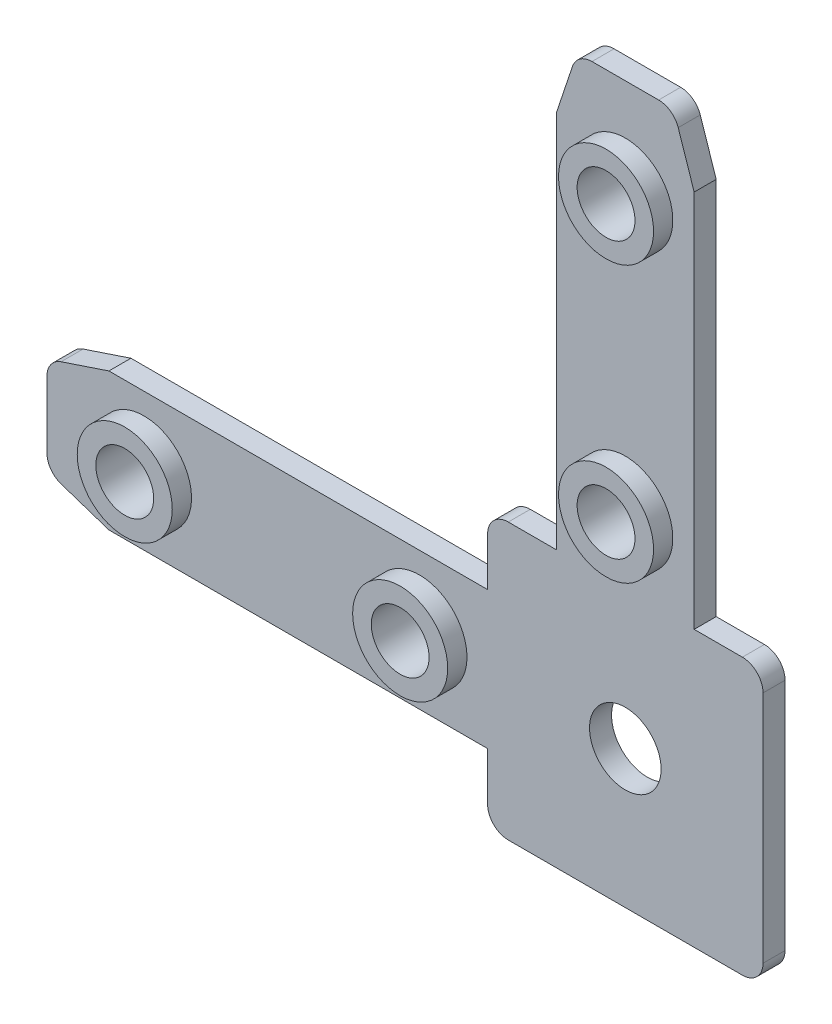
ISO-10303-21;
HEADER;
FILE_DESCRIPTION(('STEP AP214'),'2;1');
FILE_NAME('part.step','',(''),(''),'','','');
FILE_SCHEMA(('AUTOMOTIVE_DESIGN { 1 0 10303 214 1 1 1 1 }'));
ENDSEC;
DATA;
#1=APPLICATION_CONTEXT('core data for automotive mechanical design processes');
#2=APPLICATION_PROTOCOL_DEFINITION('international standard','automotive_design',2000,#1);
#3=PRODUCT_CONTEXT('',#1,'mechanical');
#4=PRODUCT('Part','Part','',(#3));
#5=PRODUCT_RELATED_PRODUCT_CATEGORY('part','',(#4));
#6=PRODUCT_DEFINITION_FORMATION('','',#4);
#7=PRODUCT_DEFINITION_CONTEXT('part definition',#1,'design');
#8=PRODUCT_DEFINITION('design','',#6,#7);
#9=PRODUCT_DEFINITION_SHAPE('','',#8);
#10=(LENGTH_UNIT() NAMED_UNIT(*) SI_UNIT(.MILLI.,.METRE.));
#11=(NAMED_UNIT(*) PLANE_ANGLE_UNIT() SI_UNIT($,.RADIAN.));
#12=(NAMED_UNIT(*) SI_UNIT($,.STERADIAN.) SOLID_ANGLE_UNIT());
#13=UNCERTAINTY_MEASURE_WITH_UNIT(LENGTH_MEASURE(1.E-05),#10,'distance_accuracy_value','');
#14=(GEOMETRIC_REPRESENTATION_CONTEXT(3) GLOBAL_UNCERTAINTY_ASSIGNED_CONTEXT((#13)) GLOBAL_UNIT_ASSIGNED_CONTEXT((#10,
#11,#12)) REPRESENTATION_CONTEXT('',''));
#15=CARTESIAN_POINT('',(0.,0.,0.));
#16=DIRECTION('',(0.,0.,1.));
#17=DIRECTION('',(1.,0.,0.));
#18=AXIS2_PLACEMENT_3D('',#15,#16,#17);
#19=CARTESIAN_POINT('',(-2.41886116991581,40.5,1.6));
#20=DIRECTION('',(0.,0.,-1.));
#21=DIRECTION('',(-1.,0.,0.));
#22=AXIS2_PLACEMENT_3D('',#19,#20,#21);
#23=PLANE('',#22);
#24=CARTESIAN_POINT('',(-14.95,0.,1.6));
#25=DIRECTION('',(0.,0.,-1.));
#26=DIRECTION('',(-1.,0.,0.));
#27=AXIS2_PLACEMENT_3D('',#24,#25,#26);
#28=CIRCLE('',#27,3.45);
#29=CARTESIAN_POINT('',(-18.4,0.,1.6));
#30=VERTEX_POINT('',#29);
#31=EDGE_CURVE('E44',#30,#30,#28,.F.);
#32=ORIENTED_EDGE('',*,*,#31,.F.);
#33=EDGE_LOOP('',(#32));
#34=FACE_BOUND('',#33,.T.);
#35=CARTESIAN_POINT('',(0.,14.95,1.6));
#36=DIRECTION('',(0.,0.,-1.));
#37=DIRECTION('',(-1.,0.,0.));
#38=AXIS2_PLACEMENT_3D('',#35,#36,#37);
#39=CIRCLE('',#38,3.45);
#40=CARTESIAN_POINT('',(-3.45,14.95,1.6));
#41=VERTEX_POINT('',#40);
#42=EDGE_CURVE('E340',#41,#41,#39,.F.);
#43=ORIENTED_EDGE('',*,*,#42,.F.);
#44=EDGE_LOOP('',(#43));
#45=FACE_BOUND('',#44,.T.);
#46=DIRECTION('',(0.,-1.,0.));
#47=VECTOR('',#46,1.);
#48=CARTESIAN_POINT('',(-5.,10.,1.6));
#49=LINE('',#48,#47);
#50=CARTESIAN_POINT('',(-5.,37.5,1.6));
#51=VERTEX_POINT('',#50);
#52=CARTESIAN_POINT('',(-5.,10.,1.6));
#53=VERTEX_POINT('',#52);
#54=EDGE_CURVE('E277',#51,#53,#49,.T.);
#55=ORIENTED_EDGE('',*,*,#54,.T.);
#56=DIRECTION('',(-1.,0.,0.));
#57=VECTOR('',#56,1.);
#58=CARTESIAN_POINT('',(-8.49999999999999,10.,1.6));
#59=LINE('',#58,#57);
#60=CARTESIAN_POINT('',(-8.49999999999999,10.,1.6));
#61=VERTEX_POINT('',#60);
#62=EDGE_CURVE('E144',#53,#61,#59,.T.);
#63=ORIENTED_EDGE('',*,*,#62,.T.);
#64=CARTESIAN_POINT('',(-8.5,8.5,1.6));
#65=DIRECTION('',(0.,0.,1.));
#66=DIRECTION('',(-1.,0.,0.));
#67=AXIS2_PLACEMENT_3D('',#64,#65,#66);
#68=CIRCLE('',#67,1.5);
#69=CARTESIAN_POINT('',(-10.,8.49999999999999,1.6));
#70=VERTEX_POINT('',#69);
#71=EDGE_CURVE('E471',#61,#70,#68,.T.);
#72=ORIENTED_EDGE('',*,*,#71,.T.);
#73=DIRECTION('',(0.,-1.,0.));
#74=VECTOR('',#73,1.);
#75=CARTESIAN_POINT('',(-10.,5.,1.6));
#76=LINE('',#75,#74);
#77=CARTESIAN_POINT('',(-10.,5.,1.6));
#78=VERTEX_POINT('',#77);
#79=EDGE_CURVE('E483',#70,#78,#76,.T.);
#80=ORIENTED_EDGE('',*,*,#79,.T.);
#81=DIRECTION('',(-1.,0.,0.));
#82=VECTOR('',#81,1.);
#83=CARTESIAN_POINT('',(-10.,5.,1.6));
#84=LINE('',#83,#82);
#85=CARTESIAN_POINT('',(-37.5,5.,1.6));
#86=VERTEX_POINT('',#85);
#87=EDGE_CURVE('E480',#78,#86,#84,.T.);
#88=ORIENTED_EDGE('',*,*,#87,.T.);
#89=DIRECTION('',(-0.948683298050514,-0.316227766016838,0.));
#90=VECTOR('',#89,1.);
#91=CARTESIAN_POINT('',(-37.5,5.,1.6));
#92=LINE('',#91,#90);
#93=CARTESIAN_POINT('',(-40.9743416490252,3.84188611699158,1.6));
#94=VERTEX_POINT('',#93);
#95=EDGE_CURVE('E482',#86,#94,#92,.T.);
#96=ORIENTED_EDGE('',*,*,#95,.T.);
#97=CARTESIAN_POINT('',(-40.5,2.41886116991581,1.6));
#98=DIRECTION('',(0.,0.,1.));
#99=DIRECTION('',(1.,0.,0.));
#100=AXIS2_PLACEMENT_3D('',#97,#98,#99);
#101=CIRCLE('',#100,1.5);
#102=CARTESIAN_POINT('',(-42.,2.4188611699158,1.6));
#103=VERTEX_POINT('',#102);
#104=EDGE_CURVE('E485',#94,#103,#101,.T.);
#105=ORIENTED_EDGE('',*,*,#104,.T.);
#106=DIRECTION('',(0.,-1.,0.));
#107=VECTOR('',#106,1.);
#108=CARTESIAN_POINT('',(-42.,2.4188611699158,1.6));
#109=LINE('',#108,#107);
#110=CARTESIAN_POINT('',(-42.,-2.4188611699158,1.6));
#111=VERTEX_POINT('',#110);
#112=EDGE_CURVE('E491',#103,#111,#109,.T.);
#113=ORIENTED_EDGE('',*,*,#112,.T.);
#114=CARTESIAN_POINT('',(-40.5,-2.41886116991581,1.6));
#115=DIRECTION('',(0.,0.,1.));
#116=DIRECTION('',(-1.,0.,0.));
#117=AXIS2_PLACEMENT_3D('',#114,#115,#116);
#118=CIRCLE('',#117,1.5);
#119=CARTESIAN_POINT('',(-40.9743416490252,-3.84188611699158,1.6));
#120=VERTEX_POINT('',#119);
#121=EDGE_CURVE('E493',#111,#120,#118,.T.);
#122=ORIENTED_EDGE('',*,*,#121,.T.);
#123=DIRECTION('',(0.948683298050514,-0.316227766016838,0.));
#124=VECTOR('',#123,1.);
#125=CARTESIAN_POINT('',(-37.5,-5.,1.6));
#126=LINE('',#125,#124);
#127=CARTESIAN_POINT('',(-37.5,-5.,1.6));
#128=VERTEX_POINT('',#127);
#129=EDGE_CURVE('E495',#120,#128,#126,.T.);
#130=ORIENTED_EDGE('',*,*,#129,.T.);
#131=DIRECTION('',(1.,0.,0.));
#132=VECTOR('',#131,1.);
#133=CARTESIAN_POINT('',(-10.,-5.,1.6));
#134=LINE('',#133,#132);
#135=CARTESIAN_POINT('',(-10.,-5.,1.6));
#136=VERTEX_POINT('',#135);
#137=EDGE_CURVE('E497',#128,#136,#134,.T.);
#138=ORIENTED_EDGE('',*,*,#137,.T.);
#139=DIRECTION('',(0.,-1.,0.));
#140=VECTOR('',#139,1.);
#141=CARTESIAN_POINT('',(-10.,-8.49999999999999,1.6));
#142=LINE('',#141,#140);
#143=CARTESIAN_POINT('',(-10.,-8.49999999999999,1.6));
#144=VERTEX_POINT('',#143);
#145=EDGE_CURVE('E499',#136,#144,#142,.T.);
#146=ORIENTED_EDGE('',*,*,#145,.T.);
#147=CARTESIAN_POINT('',(-8.5,-8.5,1.6));
#148=DIRECTION('',(0.,0.,1.));
#149=DIRECTION('',(-1.,0.,0.));
#150=AXIS2_PLACEMENT_3D('',#147,#148,#149);
#151=CIRCLE('',#150,1.5);
#152=CARTESIAN_POINT('',(-8.49999999999999,-10.,1.6));
#153=VERTEX_POINT('',#152);
#154=EDGE_CURVE('E501',#144,#153,#151,.T.);
#155=ORIENTED_EDGE('',*,*,#154,.T.);
#156=DIRECTION('',(1.,0.,0.));
#157=VECTOR('',#156,1.);
#158=CARTESIAN_POINT('',(-8.49999999999999,-10.,1.6));
#159=LINE('',#158,#157);
#160=CARTESIAN_POINT('',(8.49999999999999,-10.,1.6));
#161=VERTEX_POINT('',#160);
#162=EDGE_CURVE('E503',#153,#161,#159,.T.);
#163=ORIENTED_EDGE('',*,*,#162,.T.);
#164=CARTESIAN_POINT('',(8.5,-8.5,1.6));
#165=DIRECTION('',(0.,0.,1.));
#166=DIRECTION('',(1.,0.,0.));
#167=AXIS2_PLACEMENT_3D('',#164,#165,#166);
#168=CIRCLE('',#167,1.5);
#169=CARTESIAN_POINT('',(10.,-8.49999999999999,1.6));
#170=VERTEX_POINT('',#169);
#171=EDGE_CURVE('E505',#161,#170,#168,.T.);
#172=ORIENTED_EDGE('',*,*,#171,.T.);
#173=DIRECTION('',(0.,1.,0.));
#174=VECTOR('',#173,1.);
#175=CARTESIAN_POINT('',(10.,-8.49999999999999,1.6));
#176=LINE('',#175,#174);
#177=CARTESIAN_POINT('',(10.,8.49999999999999,1.6));
#178=VERTEX_POINT('',#177);
#179=EDGE_CURVE('E507',#170,#178,#176,.T.);
#180=ORIENTED_EDGE('',*,*,#179,.T.);
#181=CARTESIAN_POINT('',(8.5,8.5,1.6));
#182=DIRECTION('',(0.,0.,1.));
#183=DIRECTION('',(-1.,0.,0.));
#184=AXIS2_PLACEMENT_3D('',#181,#182,#183);
#185=CIRCLE('',#184,1.5);
#186=CARTESIAN_POINT('',(8.49999999999999,10.,1.6));
#187=VERTEX_POINT('',#186);
#188=EDGE_CURVE('E509',#178,#187,#185,.T.);
#189=ORIENTED_EDGE('',*,*,#188,.T.);
#190=DIRECTION('',(-1.,0.,0.));
#191=VECTOR('',#190,1.);
#192=CARTESIAN_POINT('',(8.49999999999999,10.,1.6));
#193=LINE('',#192,#191);
#194=CARTESIAN_POINT('',(5.,10.,1.6));
#195=VERTEX_POINT('',#194);
#196=EDGE_CURVE('E511',#187,#195,#193,.T.);
#197=ORIENTED_EDGE('',*,*,#196,.T.);
#198=DIRECTION('',(0.,1.,0.));
#199=VECTOR('',#198,1.);
#200=CARTESIAN_POINT('',(5.,10.,1.6));
#201=LINE('',#200,#199);
#202=CARTESIAN_POINT('',(5.,37.5,1.6));
#203=VERTEX_POINT('',#202);
#204=EDGE_CURVE('E513',#195,#203,#201,.T.);
#205=ORIENTED_EDGE('',*,*,#204,.T.);
#206=DIRECTION('',(-0.316227766016838,0.948683298050514,0.));
#207=VECTOR('',#206,1.);
#208=CARTESIAN_POINT('',(5.,37.5,1.6));
#209=LINE('',#208,#207);
#210=CARTESIAN_POINT('',(3.84188611699158,40.9743416490253,1.6));
#211=VERTEX_POINT('',#210);
#212=EDGE_CURVE('E515',#203,#211,#209,.T.);
#213=ORIENTED_EDGE('',*,*,#212,.T.);
#214=CARTESIAN_POINT('',(2.41886116991581,40.5,1.6));
#215=DIRECTION('',(0.,0.,1.));
#216=DIRECTION('',(1.,0.,0.));
#217=AXIS2_PLACEMENT_3D('',#214,#215,#216);
#218=CIRCLE('',#217,1.5);
#219=CARTESIAN_POINT('',(2.41886116991581,42.,1.6));
#220=VERTEX_POINT('',#219);
#221=EDGE_CURVE('E211',#211,#220,#218,.T.);
#222=ORIENTED_EDGE('',*,*,#221,.T.);
#223=DIRECTION('',(-1.,0.,0.));
#224=VECTOR('',#223,1.);
#225=CARTESIAN_POINT('',(-2.41886116991581,42.,1.6));
#226=LINE('',#225,#224);
#227=CARTESIAN_POINT('',(-2.41886116991581,42.,1.6));
#228=VERTEX_POINT('',#227);
#229=EDGE_CURVE('E205',#220,#228,#226,.T.);
#230=ORIENTED_EDGE('',*,*,#229,.T.);
#231=CARTESIAN_POINT('',(-2.41886116991581,40.5,1.6));
#232=DIRECTION('',(0.,0.,1.));
#233=DIRECTION('',(-1.,0.,0.));
#234=AXIS2_PLACEMENT_3D('',#231,#232,#233);
#235=CIRCLE('',#234,1.5);
#236=CARTESIAN_POINT('',(-3.84188611699159,40.9743416490253,1.6));
#237=VERTEX_POINT('',#236);
#238=EDGE_CURVE('E209',#228,#237,#235,.T.);
#239=ORIENTED_EDGE('',*,*,#238,.T.);
#240=DIRECTION('',(-0.316227766016838,-0.948683298050514,0.));
#241=VECTOR('',#240,1.);
#242=CARTESIAN_POINT('',(-5.,37.5,1.6));
#243=LINE('',#242,#241);
#244=EDGE_CURVE('E52',#237,#51,#243,.T.);
#245=ORIENTED_EDGE('',*,*,#244,.T.);
#246=EDGE_LOOP('',(#55,#63,#72,#80,#88,#96,#105,#113,#122,#130,#138,#146,#155,#163,#172,#180,
#189,#197,#205,#213,#222,#230,#239,#245));
#247=FACE_BOUND('',#246,.T.);
#248=CARTESIAN_POINT('',(0.,0.,1.6));
#249=DIRECTION('',(0.,0.,1.));
#250=DIRECTION('',(1.,0.,0.));
#251=AXIS2_PLACEMENT_3D('',#248,#249,#250);
#252=CIRCLE('',#251,2.6);
#253=CARTESIAN_POINT('',(2.6,0.,1.6));
#254=VERTEX_POINT('',#253);
#255=EDGE_CURVE('E233',#254,#254,#252,.T.);
#256=ORIENTED_EDGE('',*,*,#255,.F.);
#257=EDGE_LOOP('',(#256));
#258=FACE_BOUND('',#257,.T.);
#259=CARTESIAN_POINT('',(0.,34.95,1.6));
#260=DIRECTION('',(0.,0.,-1.));
#261=DIRECTION('',(-1.,0.,0.));
#262=AXIS2_PLACEMENT_3D('',#259,#260,#261);
#263=CIRCLE('',#262,3.45);
#264=CARTESIAN_POINT('',(-3.45,34.95,1.6));
#265=VERTEX_POINT('',#264);
#266=EDGE_CURVE('E343',#265,#265,#263,.F.);
#267=ORIENTED_EDGE('',*,*,#266,.F.);
#268=EDGE_LOOP('',(#267));
#269=FACE_BOUND('',#268,.T.);
#270=CARTESIAN_POINT('',(-34.95,0.,1.6));
#271=DIRECTION('',(0.,0.,-1.));
#272=DIRECTION('',(-1.,0.,0.));
#273=AXIS2_PLACEMENT_3D('',#270,#271,#272);
#274=CIRCLE('',#273,3.45);
#275=CARTESIAN_POINT('',(-38.4,0.,1.6));
#276=VERTEX_POINT('',#275);
#277=EDGE_CURVE('E11',#276,#276,#274,.F.);
#278=ORIENTED_EDGE('',*,*,#277,.F.);
#279=EDGE_LOOP('',(#278));
#280=FACE_BOUND('',#279,.T.);
#281=ADVANCED_FACE('F35',(#34,#45,#247,#258,#269,#280),#23,.F.);
#282=CARTESIAN_POINT('',(-2.41886116991581,40.5,0.));
#283=DIRECTION('',(0.,0.,-1.));
#284=DIRECTION('',(-1.,0.,0.));
#285=AXIS2_PLACEMENT_3D('',#282,#283,#284);
#286=PLANE('',#285);
#287=CARTESIAN_POINT('',(0.,34.95,0.));
#288=DIRECTION('',(0.,0.,1.));
#289=DIRECTION('',(1.,0.,0.));
#290=AXIS2_PLACEMENT_3D('',#287,#288,#289);
#291=CIRCLE('',#290,2.1);
#292=CARTESIAN_POINT('',(2.1,34.95,0.));
#293=VERTEX_POINT('',#292);
#294=EDGE_CURVE('E561',#293,#293,#291,.T.);
#295=ORIENTED_EDGE('',*,*,#294,.T.);
#296=EDGE_LOOP('',(#295));
#297=FACE_BOUND('',#296,.T.);
#298=CARTESIAN_POINT('',(0.,14.95,0.));
#299=DIRECTION('',(0.,0.,1.));
#300=DIRECTION('',(1.,0.,0.));
#301=AXIS2_PLACEMENT_3D('',#298,#299,#300);
#302=CIRCLE('',#301,2.1);
#303=CARTESIAN_POINT('',(2.1,14.95,0.));
#304=VERTEX_POINT('',#303);
#305=EDGE_CURVE('E555',#304,#304,#302,.T.);
#306=ORIENTED_EDGE('',*,*,#305,.T.);
#307=EDGE_LOOP('',(#306));
#308=FACE_BOUND('',#307,.T.);
#309=CARTESIAN_POINT('',(-14.95,0.,0.));
#310=DIRECTION('',(0.,0.,1.));
#311=DIRECTION('',(1.,0.,0.));
#312=AXIS2_PLACEMENT_3D('',#309,#310,#311);
#313=CIRCLE('',#312,2.1);
#314=CARTESIAN_POINT('',(-12.85,0.,0.));
#315=VERTEX_POINT('',#314);
#316=EDGE_CURVE('E549',#315,#315,#313,.T.);
#317=ORIENTED_EDGE('',*,*,#316,.T.);
#318=EDGE_LOOP('',(#317));
#319=FACE_BOUND('',#318,.T.);
#320=CARTESIAN_POINT('',(-34.95,0.,0.));
#321=DIRECTION('',(0.,0.,1.));
#322=DIRECTION('',(1.,0.,0.));
#323=AXIS2_PLACEMENT_3D('',#320,#321,#322);
#324=CIRCLE('',#323,2.1);
#325=CARTESIAN_POINT('',(-32.85,0.,0.));
#326=VERTEX_POINT('',#325);
#327=EDGE_CURVE('E543',#326,#326,#324,.T.);
#328=ORIENTED_EDGE('',*,*,#327,.T.);
#329=EDGE_LOOP('',(#328));
#330=FACE_BOUND('',#329,.T.);
#331=DIRECTION('',(0.,-1.,0.));
#332=VECTOR('',#331,1.);
#333=CARTESIAN_POINT('',(-5.,10.,0.));
#334=LINE('',#333,#332);
#335=CARTESIAN_POINT('',(-5.,37.5,0.));
#336=VERTEX_POINT('',#335);
#337=CARTESIAN_POINT('',(-5.,10.,0.));
#338=VERTEX_POINT('',#337);
#339=EDGE_CURVE('E229',#336,#338,#334,.T.);
#340=ORIENTED_EDGE('',*,*,#339,.F.);
#341=DIRECTION('',(-0.316227766016838,-0.948683298050514,0.));
#342=VECTOR('',#341,1.);
#343=CARTESIAN_POINT('',(-5.,37.5,0.));
#344=LINE('',#343,#342);
#345=CARTESIAN_POINT('',(-3.84188611699159,40.9743416490253,0.));
#346=VERTEX_POINT('',#345);
#347=EDGE_CURVE('E135',#346,#336,#344,.T.);
#348=ORIENTED_EDGE('',*,*,#347,.F.);
#349=CARTESIAN_POINT('',(-2.41886116991581,40.5,0.));
#350=DIRECTION('',(0.,0.,1.));
#351=DIRECTION('',(-1.,0.,0.));
#352=AXIS2_PLACEMENT_3D('',#349,#350,#351);
#353=CIRCLE('',#352,1.5);
#354=CARTESIAN_POINT('',(-2.41886116991581,42.,0.));
#355=VERTEX_POINT('',#354);
#356=EDGE_CURVE('E129',#355,#346,#353,.T.);
#357=ORIENTED_EDGE('',*,*,#356,.F.);
#358=DIRECTION('',(-1.,0.,0.));
#359=VECTOR('',#358,1.);
#360=CARTESIAN_POINT('',(-2.41886116991581,42.,0.));
#361=LINE('',#360,#359);
#362=CARTESIAN_POINT('',(2.41886116991581,42.,0.));
#363=VERTEX_POINT('',#362);
#364=EDGE_CURVE('E219',#363,#355,#361,.T.);
#365=ORIENTED_EDGE('',*,*,#364,.F.);
#366=CARTESIAN_POINT('',(2.41886116991581,40.5,0.));
#367=DIRECTION('',(0.,0.,1.));
#368=DIRECTION('',(1.,0.,0.));
#369=AXIS2_PLACEMENT_3D('',#366,#367,#368);
#370=CIRCLE('',#369,1.5);
#371=CARTESIAN_POINT('',(3.84188611699158,40.9743416490253,0.));
#372=VERTEX_POINT('',#371);
#373=EDGE_CURVE('E272',#372,#363,#370,.T.);
#374=ORIENTED_EDGE('',*,*,#373,.F.);
#375=DIRECTION('',(-0.316227766016838,0.948683298050514,0.));
#376=VECTOR('',#375,1.);
#377=CARTESIAN_POINT('',(5.,37.5,0.));
#378=LINE('',#377,#376);
#379=CARTESIAN_POINT('',(5.,37.5,0.));
#380=VERTEX_POINT('',#379);
#381=EDGE_CURVE('E270',#380,#372,#378,.T.);
#382=ORIENTED_EDGE('',*,*,#381,.F.);
#383=DIRECTION('',(0.,1.,0.));
#384=VECTOR('',#383,1.);
#385=CARTESIAN_POINT('',(5.,10.,0.));
#386=LINE('',#385,#384);
#387=CARTESIAN_POINT('',(5.,10.,0.));
#388=VERTEX_POINT('',#387);
#389=EDGE_CURVE('E268',#388,#380,#386,.T.);
#390=ORIENTED_EDGE('',*,*,#389,.F.);
#391=DIRECTION('',(-1.,0.,0.));
#392=VECTOR('',#391,1.);
#393=CARTESIAN_POINT('',(8.49999999999999,10.,0.));
#394=LINE('',#393,#392);
#395=CARTESIAN_POINT('',(8.49999999999999,10.,0.));
#396=VERTEX_POINT('',#395);
#397=EDGE_CURVE('E266',#396,#388,#394,.T.);
#398=ORIENTED_EDGE('',*,*,#397,.F.);
#399=CARTESIAN_POINT('',(8.5,8.5,0.));
#400=DIRECTION('',(0.,0.,1.));
#401=DIRECTION('',(-1.,0.,0.));
#402=AXIS2_PLACEMENT_3D('',#399,#400,#401);
#403=CIRCLE('',#402,1.5);
#404=CARTESIAN_POINT('',(10.,8.49999999999999,0.));
#405=VERTEX_POINT('',#404);
#406=EDGE_CURVE('E264',#405,#396,#403,.T.);
#407=ORIENTED_EDGE('',*,*,#406,.F.);
#408=DIRECTION('',(0.,1.,0.));
#409=VECTOR('',#408,1.);
#410=CARTESIAN_POINT('',(10.,-8.49999999999999,0.));
#411=LINE('',#410,#409);
#412=CARTESIAN_POINT('',(10.,-8.49999999999999,0.));
#413=VERTEX_POINT('',#412);
#414=EDGE_CURVE('E262',#413,#405,#411,.T.);
#415=ORIENTED_EDGE('',*,*,#414,.F.);
#416=CARTESIAN_POINT('',(8.5,-8.5,0.));
#417=DIRECTION('',(0.,0.,1.));
#418=DIRECTION('',(1.,0.,0.));
#419=AXIS2_PLACEMENT_3D('',#416,#417,#418);
#420=CIRCLE('',#419,1.5);
#421=CARTESIAN_POINT('',(8.49999999999999,-10.,0.));
#422=VERTEX_POINT('',#421);
#423=EDGE_CURVE('E260',#422,#413,#420,.T.);
#424=ORIENTED_EDGE('',*,*,#423,.F.);
#425=DIRECTION('',(1.,0.,0.));
#426=VECTOR('',#425,1.);
#427=CARTESIAN_POINT('',(8.49999999999999,-10.,0.));
#428=LINE('',#427,#426);
#429=CARTESIAN_POINT('',(-8.49999999999999,-10.,0.));
#430=VERTEX_POINT('',#429);
#431=EDGE_CURVE('E258',#430,#422,#428,.T.);
#432=ORIENTED_EDGE('',*,*,#431,.F.);
#433=CARTESIAN_POINT('',(-8.5,-8.5,0.));
#434=DIRECTION('',(0.,0.,1.));
#435=DIRECTION('',(-1.,0.,0.));
#436=AXIS2_PLACEMENT_3D('',#433,#434,#435);
#437=CIRCLE('',#436,1.5);
#438=CARTESIAN_POINT('',(-10.,-8.49999999999999,0.));
#439=VERTEX_POINT('',#438);
#440=EDGE_CURVE('E255',#439,#430,#437,.T.);
#441=ORIENTED_EDGE('',*,*,#440,.F.);
#442=DIRECTION('',(0.,-1.,0.));
#443=VECTOR('',#442,1.);
#444=CARTESIAN_POINT('',(-10.,-8.49999999999999,0.));
#445=LINE('',#444,#443);
#446=CARTESIAN_POINT('',(-10.,-5.,0.));
#447=VERTEX_POINT('',#446);
#448=EDGE_CURVE('E253',#447,#439,#445,.T.);
#449=ORIENTED_EDGE('',*,*,#448,.F.);
#450=DIRECTION('',(1.,0.,0.));
#451=VECTOR('',#450,1.);
#452=CARTESIAN_POINT('',(-10.,-5.,0.));
#453=LINE('',#452,#451);
#454=CARTESIAN_POINT('',(-37.5,-5.,0.));
#455=VERTEX_POINT('',#454);
#456=EDGE_CURVE('E251',#455,#447,#453,.T.);
#457=ORIENTED_EDGE('',*,*,#456,.F.);
#458=DIRECTION('',(0.948683298050514,-0.316227766016838,0.));
#459=VECTOR('',#458,1.);
#460=CARTESIAN_POINT('',(-37.5,-5.,0.));
#461=LINE('',#460,#459);
#462=CARTESIAN_POINT('',(-40.9743416490252,-3.84188611699158,0.));
#463=VERTEX_POINT('',#462);
#464=EDGE_CURVE('E249',#463,#455,#461,.T.);
#465=ORIENTED_EDGE('',*,*,#464,.F.);
#466=CARTESIAN_POINT('',(-40.5,-2.41886116991581,0.));
#467=DIRECTION('',(0.,0.,1.));
#468=DIRECTION('',(-1.,0.,0.));
#469=AXIS2_PLACEMENT_3D('',#466,#467,#468);
#470=CIRCLE('',#469,1.5);
#471=CARTESIAN_POINT('',(-42.,-2.4188611699158,0.));
#472=VERTEX_POINT('',#471);
#473=EDGE_CURVE('E247',#472,#463,#470,.T.);
#474=ORIENTED_EDGE('',*,*,#473,.F.);
#475=DIRECTION('',(0.,-1.,0.));
#476=VECTOR('',#475,1.);
#477=CARTESIAN_POINT('',(-42.,2.4188611699158,0.));
#478=LINE('',#477,#476);
#479=CARTESIAN_POINT('',(-42.,2.4188611699158,0.));
#480=VERTEX_POINT('',#479);
#481=EDGE_CURVE('E245',#480,#472,#478,.T.);
#482=ORIENTED_EDGE('',*,*,#481,.F.);
#483=CARTESIAN_POINT('',(-40.5,2.41886116991581,0.));
#484=DIRECTION('',(0.,0.,1.));
#485=DIRECTION('',(1.,0.,0.));
#486=AXIS2_PLACEMENT_3D('',#483,#484,#485);
#487=CIRCLE('',#486,1.5);
#488=CARTESIAN_POINT('',(-40.9743416490252,3.84188611699158,0.));
#489=VERTEX_POINT('',#488);
#490=EDGE_CURVE('E243',#489,#480,#487,.T.);
#491=ORIENTED_EDGE('',*,*,#490,.F.);
#492=DIRECTION('',(-0.948683298050514,-0.316227766016838,0.));
#493=VECTOR('',#492,1.);
#494=CARTESIAN_POINT('',(-37.5,5.,0.));
#495=LINE('',#494,#493);
#496=CARTESIAN_POINT('',(-37.5,5.,0.));
#497=VERTEX_POINT('',#496);
#498=EDGE_CURVE('E241',#497,#489,#495,.T.);
#499=ORIENTED_EDGE('',*,*,#498,.F.);
#500=DIRECTION('',(-1.,0.,0.));
#501=VECTOR('',#500,1.);
#502=CARTESIAN_POINT('',(-10.,5.,0.));
#503=LINE('',#502,#501);
#504=CARTESIAN_POINT('',(-10.,5.,0.));
#505=VERTEX_POINT('',#504);
#506=EDGE_CURVE('E239',#505,#497,#503,.T.);
#507=ORIENTED_EDGE('',*,*,#506,.F.);
#508=DIRECTION('',(0.,-1.,0.));
#509=VECTOR('',#508,1.);
#510=CARTESIAN_POINT('',(-10.,5.,0.));
#511=LINE('',#510,#509);
#512=CARTESIAN_POINT('',(-10.,8.49999999999999,0.));
#513=VERTEX_POINT('',#512);
#514=EDGE_CURVE('E237',#513,#505,#511,.T.);
#515=ORIENTED_EDGE('',*,*,#514,.F.);
#516=CARTESIAN_POINT('',(-8.5,8.5,0.));
#517=DIRECTION('',(0.,0.,1.));
#518=DIRECTION('',(-1.,0.,0.));
#519=AXIS2_PLACEMENT_3D('',#516,#517,#518);
#520=CIRCLE('',#519,1.5);
#521=CARTESIAN_POINT('',(-8.49999999999999,10.,0.));
#522=VERTEX_POINT('',#521);
#523=EDGE_CURVE('E235',#522,#513,#520,.T.);
#524=ORIENTED_EDGE('',*,*,#523,.F.);
#525=DIRECTION('',(-1.,0.,0.));
#526=VECTOR('',#525,1.);
#527=CARTESIAN_POINT('',(-8.49999999999999,10.,0.));
#528=LINE('',#527,#526);
#529=EDGE_CURVE('E232',#338,#522,#528,.T.);
#530=ORIENTED_EDGE('',*,*,#529,.F.);
#531=EDGE_LOOP('',(#340,#348,#357,#365,#374,#382,#390,#398,#407,#415,#424,#432,#441,#449,#457,
#465,#474,#482,#491,#499,#507,#515,#524,#530));
#532=FACE_BOUND('',#531,.T.);
#533=CARTESIAN_POINT('',(0.,0.,0.));
#534=DIRECTION('',(0.,0.,1.));
#535=DIRECTION('',(1.,0.,0.));
#536=AXIS2_PLACEMENT_3D('',#533,#534,#535);
#537=CIRCLE('',#536,2.6);
#538=CARTESIAN_POINT('',(2.6,0.,0.));
#539=VERTEX_POINT('',#538);
#540=EDGE_CURVE('E526',#539,#539,#537,.T.);
#541=ORIENTED_EDGE('',*,*,#540,.T.);
#542=EDGE_LOOP('',(#541));
#543=FACE_BOUND('',#542,.T.);
#544=ADVANCED_FACE('F352',(#297,#308,#319,#330,#532,#543),#286,.T.);
#545=CARTESIAN_POINT('',(-5.,10.,1.6));
#546=DIRECTION('',(1.,0.,0.));
#547=DIRECTION('',(0.,1.,0.));
#548=AXIS2_PLACEMENT_3D('',#545,#546,#547);
#549=PLANE('',#548);
#550=ORIENTED_EDGE('',*,*,#339,.T.);
#551=DIRECTION('',(0.,0.,-1.));
#552=VECTOR('',#551,1.);
#553=CARTESIAN_POINT('',(-5.,10.,1.6));
#554=LINE('',#553,#552);
#555=EDGE_CURVE('E338',#53,#338,#554,.T.);
#556=ORIENTED_EDGE('',*,*,#555,.F.);
#557=ORIENTED_EDGE('',*,*,#54,.F.);
#558=DIRECTION('',(0.,0.,-1.));
#559=VECTOR('',#558,1.);
#560=CARTESIAN_POINT('',(-5.,37.5,1.6));
#561=LINE('',#560,#559);
#562=EDGE_CURVE('E225',#51,#336,#561,.T.);
#563=ORIENTED_EDGE('',*,*,#562,.T.);
#564=EDGE_LOOP('',(#550,#556,#557,#563));
#565=FACE_BOUND('',#564,.T.);
#566=ADVANCED_FACE('F37',(#565),#549,.F.);
#567=CARTESIAN_POINT('',(-8.49999999999999,10.,1.6));
#568=DIRECTION('',(0.,-1.,0.));
#569=DIRECTION('',(1.,0.,0.));
#570=AXIS2_PLACEMENT_3D('',#567,#568,#569);
#571=PLANE('',#570);
#572=ORIENTED_EDGE('',*,*,#529,.T.);
#573=DIRECTION('',(0.,0.,-1.));
#574=VECTOR('',#573,1.);
#575=CARTESIAN_POINT('',(-8.49999999999999,10.,1.6));
#576=LINE('',#575,#574);
#577=EDGE_CURVE('E335',#61,#522,#576,.T.);
#578=ORIENTED_EDGE('',*,*,#577,.F.);
#579=ORIENTED_EDGE('',*,*,#62,.F.);
#580=ORIENTED_EDGE('',*,*,#555,.T.);
#581=EDGE_LOOP('',(#572,#578,#579,#580));
#582=FACE_BOUND('',#581,.T.);
#583=ADVANCED_FACE('F458',(#582),#571,.F.);
#584=CARTESIAN_POINT('',(-8.5,8.5,1.6));
#585=DIRECTION('',(0.,0.,-1.));
#586=DIRECTION('',(-1.,0.,0.));
#587=AXIS2_PLACEMENT_3D('',#584,#585,#586);
#588=CYLINDRICAL_SURFACE('',#587,1.5);
#589=ORIENTED_EDGE('',*,*,#523,.T.);
#590=DIRECTION('',(0.,0.,-1.));
#591=VECTOR('',#590,1.);
#592=CARTESIAN_POINT('',(-10.,8.49999999999999,1.6));
#593=LINE('',#592,#591);
#594=EDGE_CURVE('E332',#70,#513,#593,.T.);
#595=ORIENTED_EDGE('',*,*,#594,.F.);
#596=ORIENTED_EDGE('',*,*,#71,.F.);
#597=ORIENTED_EDGE('',*,*,#577,.T.);
#598=EDGE_LOOP('',(#589,#595,#596,#597));
#599=FACE_BOUND('',#598,.T.);
#600=ADVANCED_FACE('F455',(#599),#588,.T.);
#601=CARTESIAN_POINT('',(-10.,5.,1.6));
#602=DIRECTION('',(1.,0.,0.));
#603=DIRECTION('',(0.,0.,-1.));
#604=AXIS2_PLACEMENT_3D('',#601,#602,#603);
#605=PLANE('',#604);
#606=ORIENTED_EDGE('',*,*,#514,.T.);
#607=DIRECTION('',(0.,0.,-1.));
#608=VECTOR('',#607,1.);
#609=CARTESIAN_POINT('',(-10.,5.,1.6));
#610=LINE('',#609,#608);
#611=EDGE_CURVE('E329',#78,#505,#610,.T.);
#612=ORIENTED_EDGE('',*,*,#611,.F.);
#613=ORIENTED_EDGE('',*,*,#79,.F.);
#614=ORIENTED_EDGE('',*,*,#594,.T.);
#615=EDGE_LOOP('',(#606,#612,#613,#614));
#616=FACE_BOUND('',#615,.T.);
#617=ADVANCED_FACE('F451',(#616),#605,.F.);
#618=CARTESIAN_POINT('',(-10.,5.,1.6));
#619=DIRECTION('',(0.,-1.,0.));
#620=DIRECTION('',(1.,0.,0.));
#621=AXIS2_PLACEMENT_3D('',#618,#619,#620);
#622=PLANE('',#621);
#623=ORIENTED_EDGE('',*,*,#506,.T.);
#624=DIRECTION('',(0.,0.,-1.));
#625=VECTOR('',#624,1.);
#626=CARTESIAN_POINT('',(-37.5,5.,1.6));
#627=LINE('',#626,#625);
#628=EDGE_CURVE('E326',#86,#497,#627,.T.);
#629=ORIENTED_EDGE('',*,*,#628,.F.);
#630=ORIENTED_EDGE('',*,*,#87,.F.);
#631=ORIENTED_EDGE('',*,*,#611,.T.);
#632=EDGE_LOOP('',(#623,#629,#630,#631));
#633=FACE_BOUND('',#632,.T.);
#634=ADVANCED_FACE('F447',(#633),#622,.F.);
#635=CARTESIAN_POINT('',(-37.5,5.,1.6));
#636=DIRECTION('',(0.316227766016838,-0.948683298050514,0.));
#637=DIRECTION('',(0.948683298050514,0.316227766016838,0.));
#638=AXIS2_PLACEMENT_3D('',#635,#636,#637);
#639=PLANE('',#638);
#640=ORIENTED_EDGE('',*,*,#498,.T.);
#641=DIRECTION('',(0.,0.,-1.));
#642=VECTOR('',#641,1.);
#643=CARTESIAN_POINT('',(-40.9743416490252,3.84188611699158,1.6));
#644=LINE('',#643,#642);
#645=EDGE_CURVE('E323',#94,#489,#644,.T.);
#646=ORIENTED_EDGE('',*,*,#645,.F.);
#647=ORIENTED_EDGE('',*,*,#95,.F.);
#648=ORIENTED_EDGE('',*,*,#628,.T.);
#649=EDGE_LOOP('',(#640,#646,#647,#648));
#650=FACE_BOUND('',#649,.T.);
#651=ADVANCED_FACE('F443',(#650),#639,.F.);
#652=CARTESIAN_POINT('',(-40.5,2.41886116991581,1.6));
#653=DIRECTION('',(0.,0.,-1.));
#654=DIRECTION('',(-1.,0.,0.));
#655=AXIS2_PLACEMENT_3D('',#652,#653,#654);
#656=CYLINDRICAL_SURFACE('',#655,1.5);
#657=ORIENTED_EDGE('',*,*,#490,.T.);
#658=DIRECTION('',(0.,0.,-1.));
#659=VECTOR('',#658,1.);
#660=CARTESIAN_POINT('',(-42.,2.4188611699158,1.6));
#661=LINE('',#660,#659);
#662=EDGE_CURVE('E320',#103,#480,#661,.T.);
#663=ORIENTED_EDGE('',*,*,#662,.F.);
#664=ORIENTED_EDGE('',*,*,#104,.F.);
#665=ORIENTED_EDGE('',*,*,#645,.T.);
#666=EDGE_LOOP('',(#657,#663,#664,#665));
#667=FACE_BOUND('',#666,.T.);
#668=ADVANCED_FACE('F439',(#667),#656,.T.);
#669=CARTESIAN_POINT('',(-42.,2.4188611699158,1.6));
#670=DIRECTION('',(1.,0.,0.));
#671=DIRECTION('',(0.,0.,-1.));
#672=AXIS2_PLACEMENT_3D('',#669,#670,#671);
#673=PLANE('',#672);
#674=ORIENTED_EDGE('',*,*,#481,.T.);
#675=DIRECTION('',(0.,0.,-1.));
#676=VECTOR('',#675,1.);
#677=CARTESIAN_POINT('',(-42.,-2.4188611699158,1.6));
#678=LINE('',#677,#676);
#679=EDGE_CURVE('E317',#111,#472,#678,.T.);
#680=ORIENTED_EDGE('',*,*,#679,.F.);
#681=ORIENTED_EDGE('',*,*,#112,.F.);
#682=ORIENTED_EDGE('',*,*,#662,.T.);
#683=EDGE_LOOP('',(#674,#680,#681,#682));
#684=FACE_BOUND('',#683,.T.);
#685=ADVANCED_FACE('F435',(#684),#673,.F.);
#686=CARTESIAN_POINT('',(-40.5,-2.41886116991581,1.6));
#687=DIRECTION('',(0.,0.,-1.));
#688=DIRECTION('',(-1.,0.,0.));
#689=AXIS2_PLACEMENT_3D('',#686,#687,#688);
#690=CYLINDRICAL_SURFACE('',#689,1.5);
#691=ORIENTED_EDGE('',*,*,#473,.T.);
#692=DIRECTION('',(0.,0.,-1.));
#693=VECTOR('',#692,1.);
#694=CARTESIAN_POINT('',(-40.9743416490252,-3.84188611699158,1.6));
#695=LINE('',#694,#693);
#696=EDGE_CURVE('E314',#120,#463,#695,.T.);
#697=ORIENTED_EDGE('',*,*,#696,.F.);
#698=ORIENTED_EDGE('',*,*,#121,.F.);
#699=ORIENTED_EDGE('',*,*,#679,.T.);
#700=EDGE_LOOP('',(#691,#697,#698,#699));
#701=FACE_BOUND('',#700,.T.);
#702=ADVANCED_FACE('F431',(#701),#690,.T.);
#703=CARTESIAN_POINT('',(-37.5,-5.,1.6));
#704=DIRECTION('',(0.316227766016838,0.948683298050514,0.));
#705=DIRECTION('',(-0.948683298050514,0.316227766016838,0.));
#706=AXIS2_PLACEMENT_3D('',#703,#704,#705);
#707=PLANE('',#706);
#708=ORIENTED_EDGE('',*,*,#464,.T.);
#709=DIRECTION('',(0.,0.,-1.));
#710=VECTOR('',#709,1.);
#711=CARTESIAN_POINT('',(-37.5,-5.,1.6));
#712=LINE('',#711,#710);
#713=EDGE_CURVE('E311',#128,#455,#712,.T.);
#714=ORIENTED_EDGE('',*,*,#713,.F.);
#715=ORIENTED_EDGE('',*,*,#129,.F.);
#716=ORIENTED_EDGE('',*,*,#696,.T.);
#717=EDGE_LOOP('',(#708,#714,#715,#716));
#718=FACE_BOUND('',#717,.T.);
#719=ADVANCED_FACE('F427',(#718),#707,.F.);
#720=CARTESIAN_POINT('',(-10.,-5.,1.6));
#721=DIRECTION('',(0.,1.,0.));
#722=DIRECTION('',(-1.,0.,0.));
#723=AXIS2_PLACEMENT_3D('',#720,#721,#722);
#724=PLANE('',#723);
#725=ORIENTED_EDGE('',*,*,#456,.T.);
#726=DIRECTION('',(0.,0.,-1.));
#727=VECTOR('',#726,1.);
#728=CARTESIAN_POINT('',(-10.,-5.,1.6));
#729=LINE('',#728,#727);
#730=EDGE_CURVE('E308',#136,#447,#729,.T.);
#731=ORIENTED_EDGE('',*,*,#730,.F.);
#732=ORIENTED_EDGE('',*,*,#137,.F.);
#733=ORIENTED_EDGE('',*,*,#713,.T.);
#734=EDGE_LOOP('',(#725,#731,#732,#733));
#735=FACE_BOUND('',#734,.T.);
#736=ADVANCED_FACE('F423',(#735),#724,.F.);
#737=CARTESIAN_POINT('',(-10.,-8.49999999999999,1.6));
#738=DIRECTION('',(1.,0.,0.));
#739=DIRECTION('',(0.,0.,-1.));
#740=AXIS2_PLACEMENT_3D('',#737,#738,#739);
#741=PLANE('',#740);
#742=ORIENTED_EDGE('',*,*,#448,.T.);
#743=DIRECTION('',(0.,0.,-1.));
#744=VECTOR('',#743,1.);
#745=CARTESIAN_POINT('',(-10.,-8.49999999999999,1.6));
#746=LINE('',#745,#744);
#747=EDGE_CURVE('E305',#144,#439,#746,.T.);
#748=ORIENTED_EDGE('',*,*,#747,.F.);
#749=ORIENTED_EDGE('',*,*,#145,.F.);
#750=ORIENTED_EDGE('',*,*,#730,.T.);
#751=EDGE_LOOP('',(#742,#748,#749,#750));
#752=FACE_BOUND('',#751,.T.);
#753=ADVANCED_FACE('F419',(#752),#741,.F.);
#754=CARTESIAN_POINT('',(-8.5,-8.5,1.6));
#755=DIRECTION('',(0.,0.,-1.));
#756=DIRECTION('',(-1.,0.,0.));
#757=AXIS2_PLACEMENT_3D('',#754,#755,#756);
#758=CYLINDRICAL_SURFACE('',#757,1.5);
#759=ORIENTED_EDGE('',*,*,#440,.T.);
#760=DIRECTION('',(0.,0.,-1.));
#761=VECTOR('',#760,1.);
#762=CARTESIAN_POINT('',(-8.49999999999999,-10.,1.6));
#763=LINE('',#762,#761);
#764=EDGE_CURVE('E302',#153,#430,#763,.T.);
#765=ORIENTED_EDGE('',*,*,#764,.F.);
#766=ORIENTED_EDGE('',*,*,#154,.F.);
#767=ORIENTED_EDGE('',*,*,#747,.T.);
#768=EDGE_LOOP('',(#759,#765,#766,#767));
#769=FACE_BOUND('',#768,.T.);
#770=ADVANCED_FACE('F415',(#769),#758,.T.);
#771=CARTESIAN_POINT('',(8.49999999999999,-10.,1.6));
#772=DIRECTION('',(0.,1.,0.));
#773=DIRECTION('',(-1.,0.,0.));
#774=AXIS2_PLACEMENT_3D('',#771,#772,#773);
#775=PLANE('',#774);
#776=ORIENTED_EDGE('',*,*,#431,.T.);
#777=DIRECTION('',(0.,0.,-1.));
#778=VECTOR('',#777,1.);
#779=CARTESIAN_POINT('',(8.49999999999999,-10.,1.6));
#780=LINE('',#779,#778);
#781=EDGE_CURVE('E299',#161,#422,#780,.T.);
#782=ORIENTED_EDGE('',*,*,#781,.F.);
#783=ORIENTED_EDGE('',*,*,#162,.F.);
#784=ORIENTED_EDGE('',*,*,#764,.T.);
#785=EDGE_LOOP('',(#776,#782,#783,#784));
#786=FACE_BOUND('',#785,.T.);
#787=ADVANCED_FACE('F411',(#786),#775,.F.);
#788=CARTESIAN_POINT('',(8.5,-8.5,1.6));
#789=DIRECTION('',(0.,0.,-1.));
#790=DIRECTION('',(-1.,0.,0.));
#791=AXIS2_PLACEMENT_3D('',#788,#789,#790);
#792=CYLINDRICAL_SURFACE('',#791,1.5);
#793=ORIENTED_EDGE('',*,*,#423,.T.);
#794=DIRECTION('',(0.,0.,-1.));
#795=VECTOR('',#794,1.);
#796=CARTESIAN_POINT('',(10.,-8.49999999999999,1.6));
#797=LINE('',#796,#795);
#798=EDGE_CURVE('E296',#170,#413,#797,.T.);
#799=ORIENTED_EDGE('',*,*,#798,.F.);
#800=ORIENTED_EDGE('',*,*,#171,.F.);
#801=ORIENTED_EDGE('',*,*,#781,.T.);
#802=EDGE_LOOP('',(#793,#799,#800,#801));
#803=FACE_BOUND('',#802,.T.);
#804=ADVANCED_FACE('F407',(#803),#792,.T.);
#805=CARTESIAN_POINT('',(10.,-8.49999999999999,1.6));
#806=DIRECTION('',(-1.,0.,0.));
#807=DIRECTION('',(0.,0.,1.));
#808=AXIS2_PLACEMENT_3D('',#805,#806,#807);
#809=PLANE('',#808);
#810=ORIENTED_EDGE('',*,*,#414,.T.);
#811=DIRECTION('',(0.,0.,-1.));
#812=VECTOR('',#811,1.);
#813=CARTESIAN_POINT('',(10.,8.49999999999999,1.6));
#814=LINE('',#813,#812);
#815=EDGE_CURVE('E293',#178,#405,#814,.T.);
#816=ORIENTED_EDGE('',*,*,#815,.F.);
#817=ORIENTED_EDGE('',*,*,#179,.F.);
#818=ORIENTED_EDGE('',*,*,#798,.T.);
#819=EDGE_LOOP('',(#810,#816,#817,#818));
#820=FACE_BOUND('',#819,.T.);
#821=ADVANCED_FACE('F403',(#820),#809,.F.);
#822=CARTESIAN_POINT('',(8.5,8.5,1.6));
#823=DIRECTION('',(0.,0.,-1.));
#824=DIRECTION('',(-1.,0.,0.));
#825=AXIS2_PLACEMENT_3D('',#822,#823,#824);
#826=CYLINDRICAL_SURFACE('',#825,1.5);
#827=ORIENTED_EDGE('',*,*,#406,.T.);
#828=DIRECTION('',(0.,0.,-1.));
#829=VECTOR('',#828,1.);
#830=CARTESIAN_POINT('',(8.49999999999999,10.,1.6));
#831=LINE('',#830,#829);
#832=EDGE_CURVE('E290',#187,#396,#831,.T.);
#833=ORIENTED_EDGE('',*,*,#832,.F.);
#834=ORIENTED_EDGE('',*,*,#188,.F.);
#835=ORIENTED_EDGE('',*,*,#815,.T.);
#836=EDGE_LOOP('',(#827,#833,#834,#835));
#837=FACE_BOUND('',#836,.T.);
#838=ADVANCED_FACE('F399',(#837),#826,.T.);
#839=CARTESIAN_POINT('',(8.49999999999999,10.,1.6));
#840=DIRECTION('',(0.,-1.,0.));
#841=DIRECTION('',(1.,0.,0.));
#842=AXIS2_PLACEMENT_3D('',#839,#840,#841);
#843=PLANE('',#842);
#844=ORIENTED_EDGE('',*,*,#397,.T.);
#845=DIRECTION('',(0.,0.,-1.));
#846=VECTOR('',#845,1.);
#847=CARTESIAN_POINT('',(5.,10.,1.6));
#848=LINE('',#847,#846);
#849=EDGE_CURVE('E287',#195,#388,#848,.T.);
#850=ORIENTED_EDGE('',*,*,#849,.F.);
#851=ORIENTED_EDGE('',*,*,#196,.F.);
#852=ORIENTED_EDGE('',*,*,#832,.T.);
#853=EDGE_LOOP('',(#844,#850,#851,#852));
#854=FACE_BOUND('',#853,.T.);
#855=ADVANCED_FACE('F395',(#854),#843,.F.);
#856=CARTESIAN_POINT('',(5.,10.,1.6));
#857=DIRECTION('',(-1.,0.,0.));
#858=DIRECTION('',(0.,-1.,0.));
#859=AXIS2_PLACEMENT_3D('',#856,#857,#858);
#860=PLANE('',#859);
#861=ORIENTED_EDGE('',*,*,#389,.T.);
#862=DIRECTION('',(0.,0.,-1.));
#863=VECTOR('',#862,1.);
#864=CARTESIAN_POINT('',(5.,37.5,1.6));
#865=LINE('',#864,#863);
#866=EDGE_CURVE('E284',#203,#380,#865,.T.);
#867=ORIENTED_EDGE('',*,*,#866,.F.);
#868=ORIENTED_EDGE('',*,*,#204,.F.);
#869=ORIENTED_EDGE('',*,*,#849,.T.);
#870=EDGE_LOOP('',(#861,#867,#868,#869));
#871=FACE_BOUND('',#870,.T.);
#872=ADVANCED_FACE('F391',(#871),#860,.F.);
#873=CARTESIAN_POINT('',(5.,37.5,1.6));
#874=DIRECTION('',(-0.948683298050514,-0.316227766016838,0.));
#875=DIRECTION('',(0.316227766016838,-0.948683298050514,0.));
#876=AXIS2_PLACEMENT_3D('',#873,#874,#875);
#877=PLANE('',#876);
#878=ORIENTED_EDGE('',*,*,#381,.T.);
#879=DIRECTION('',(0.,0.,-1.));
#880=VECTOR('',#879,1.);
#881=CARTESIAN_POINT('',(3.84188611699158,40.9743416490253,1.6));
#882=LINE('',#881,#880);
#883=EDGE_CURVE('E281',#211,#372,#882,.T.);
#884=ORIENTED_EDGE('',*,*,#883,.F.);
#885=ORIENTED_EDGE('',*,*,#212,.F.);
#886=ORIENTED_EDGE('',*,*,#866,.T.);
#887=EDGE_LOOP('',(#878,#884,#885,#886));
#888=FACE_BOUND('',#887,.T.);
#889=ADVANCED_FACE('F387',(#888),#877,.F.);
#890=CARTESIAN_POINT('',(2.41886116991581,40.5,1.6));
#891=DIRECTION('',(0.,0.,-1.));
#892=DIRECTION('',(-1.,0.,0.));
#893=AXIS2_PLACEMENT_3D('',#890,#891,#892);
#894=CYLINDRICAL_SURFACE('',#893,1.5);
#895=ORIENTED_EDGE('',*,*,#373,.T.);
#896=DIRECTION('',(0.,0.,-1.));
#897=VECTOR('',#896,1.);
#898=CARTESIAN_POINT('',(2.41886116991581,42.,1.6));
#899=LINE('',#898,#897);
#900=EDGE_CURVE('E220',#220,#363,#899,.T.);
#901=ORIENTED_EDGE('',*,*,#900,.F.);
#902=ORIENTED_EDGE('',*,*,#221,.F.);
#903=ORIENTED_EDGE('',*,*,#883,.T.);
#904=EDGE_LOOP('',(#895,#901,#902,#903));
#905=FACE_BOUND('',#904,.T.);
#906=ADVANCED_FACE('F384',(#905),#894,.T.);
#907=CARTESIAN_POINT('',(-2.41886116991581,42.,1.6));
#908=DIRECTION('',(0.,-1.,0.));
#909=DIRECTION('',(0.,0.,-1.));
#910=AXIS2_PLACEMENT_3D('',#907,#908,#909);
#911=PLANE('',#910);
#912=ORIENTED_EDGE('',*,*,#364,.T.);
#913=DIRECTION('',(0.,0.,-1.));
#914=VECTOR('',#913,1.);
#915=CARTESIAN_POINT('',(-2.41886116991581,42.,1.6));
#916=LINE('',#915,#914);
#917=EDGE_CURVE('E216',#228,#355,#916,.T.);
#918=ORIENTED_EDGE('',*,*,#917,.F.);
#919=ORIENTED_EDGE('',*,*,#229,.F.);
#920=ORIENTED_EDGE('',*,*,#900,.T.);
#921=EDGE_LOOP('',(#912,#918,#919,#920));
#922=FACE_BOUND('',#921,.T.);
#923=ADVANCED_FACE('F217',(#922),#911,.F.);
#924=CARTESIAN_POINT('',(-2.41886116991581,40.5,1.6));
#925=DIRECTION('',(0.,0.,-1.));
#926=DIRECTION('',(-1.,0.,0.));
#927=AXIS2_PLACEMENT_3D('',#924,#925,#926);
#928=CYLINDRICAL_SURFACE('',#927,1.5);
#929=ORIENTED_EDGE('',*,*,#356,.T.);
#930=DIRECTION('',(0.,0.,-1.));
#931=VECTOR('',#930,1.);
#932=CARTESIAN_POINT('',(-3.84188611699159,40.9743416490253,1.6));
#933=LINE('',#932,#931);
#934=EDGE_CURVE('E221',#237,#346,#933,.T.);
#935=ORIENTED_EDGE('',*,*,#934,.F.);
#936=ORIENTED_EDGE('',*,*,#238,.F.);
#937=ORIENTED_EDGE('',*,*,#917,.T.);
#938=EDGE_LOOP('',(#929,#935,#936,#937));
#939=FACE_BOUND('',#938,.T.);
#940=ADVANCED_FACE('F223',(#939),#928,.T.);
#941=CARTESIAN_POINT('',(-5.,37.5,1.6));
#942=DIRECTION('',(0.948683298050514,-0.316227766016838,0.));
#943=DIRECTION('',(0.316227766016838,0.948683298050514,0.));
#944=AXIS2_PLACEMENT_3D('',#941,#942,#943);
#945=PLANE('',#944);
#946=ORIENTED_EDGE('',*,*,#347,.T.);
#947=ORIENTED_EDGE('',*,*,#562,.F.);
#948=ORIENTED_EDGE('',*,*,#244,.F.);
#949=ORIENTED_EDGE('',*,*,#934,.T.);
#950=EDGE_LOOP('',(#946,#947,#948,#949));
#951=FACE_BOUND('',#950,.T.);
#952=ADVANCED_FACE('F369',(#951),#945,.F.);
#953=CARTESIAN_POINT('',(0.,0.,1.6));
#954=DIRECTION('',(0.,0.,-1.));
#955=DIRECTION('',(-1.,0.,0.));
#956=AXIS2_PLACEMENT_3D('',#953,#954,#955);
#957=CYLINDRICAL_SURFACE('',#956,2.6);
#958=ORIENTED_EDGE('',*,*,#255,.T.);
#959=EDGE_LOOP('',(#958));
#960=FACE_BOUND('',#959,.T.);
#961=ORIENTED_EDGE('',*,*,#540,.F.);
#962=EDGE_LOOP('',(#961));
#963=FACE_BOUND('',#962,.T.);
#964=ADVANCED_FACE('F359',(#960,#963),#957,.F.);
#965=CARTESIAN_POINT('',(0.,14.95,3.));
#966=DIRECTION('',(0.,0.,-1.));
#967=DIRECTION('',(-1.,0.,0.));
#968=AXIS2_PLACEMENT_3D('',#965,#966,#967);
#969=CYLINDRICAL_SURFACE('',#968,3.45);
#970=CARTESIAN_POINT('',(0.,14.95,3.));
#971=DIRECTION('',(0.,0.,1.));
#972=DIRECTION('',(1.,0.,0.));
#973=AXIS2_PLACEMENT_3D('',#970,#971,#972);
#974=CIRCLE('',#973,3.45);
#975=CARTESIAN_POINT('',(3.45,14.95,3.));
#976=VERTEX_POINT('',#975);
#977=EDGE_CURVE('E529',#976,#976,#974,.T.);
#978=ORIENTED_EDGE('',*,*,#977,.F.);
#979=EDGE_LOOP('',(#978));
#980=FACE_BOUND('',#979,.T.);
#981=ORIENTED_EDGE('',*,*,#42,.T.);
#982=EDGE_LOOP('',(#981));
#983=FACE_BOUND('',#982,.T.);
#984=ADVANCED_FACE('F356',(#980,#983),#969,.T.);
#985=CARTESIAN_POINT('',(0.,14.95,3.));
#986=DIRECTION('',(0.,0.,1.));
#987=DIRECTION('',(1.,0.,0.));
#988=AXIS2_PLACEMENT_3D('',#985,#986,#987);
#989=PLANE('',#988);
#990=CARTESIAN_POINT('',(0.,14.95,3.));
#991=DIRECTION('',(0.,0.,1.));
#992=DIRECTION('',(1.,0.,0.));
#993=AXIS2_PLACEMENT_3D('',#990,#991,#992);
#994=CIRCLE('',#993,2.1);
#995=CARTESIAN_POINT('',(2.1,14.95,3.));
#996=VERTEX_POINT('',#995);
#997=EDGE_CURVE('E558',#996,#996,#994,.T.);
#998=ORIENTED_EDGE('',*,*,#997,.F.);
#999=EDGE_LOOP('',(#998));
#1000=FACE_BOUND('',#999,.T.);
#1001=ORIENTED_EDGE('',*,*,#977,.T.);
#1002=EDGE_LOOP('',(#1001));
#1003=FACE_BOUND('',#1002,.T.);
#1004=ADVANCED_FACE('F358',(#1000,#1003),#989,.T.);
#1005=CARTESIAN_POINT('',(0.,34.95,3.));
#1006=DIRECTION('',(0.,0.,-1.));
#1007=DIRECTION('',(-1.,0.,0.));
#1008=AXIS2_PLACEMENT_3D('',#1005,#1006,#1007);
#1009=CYLINDRICAL_SURFACE('',#1008,3.45);
#1010=CARTESIAN_POINT('',(0.,34.95,3.));
#1011=DIRECTION('',(0.,0.,1.));
#1012=DIRECTION('',(1.,0.,0.));
#1013=AXIS2_PLACEMENT_3D('',#1010,#1011,#1012);
#1014=CIRCLE('',#1013,3.45);
#1015=CARTESIAN_POINT('',(3.45,34.95,3.));
#1016=VERTEX_POINT('',#1015);
#1017=EDGE_CURVE('E534',#1016,#1016,#1014,.T.);
#1018=ORIENTED_EDGE('',*,*,#1017,.F.);
#1019=EDGE_LOOP('',(#1018));
#1020=FACE_BOUND('',#1019,.T.);
#1021=ORIENTED_EDGE('',*,*,#266,.T.);
#1022=EDGE_LOOP('',(#1021));
#1023=FACE_BOUND('',#1022,.T.);
#1024=ADVANCED_FACE('F366',(#1020,#1023),#1009,.T.);
#1025=CARTESIAN_POINT('',(0.,34.95,3.));
#1026=DIRECTION('',(0.,0.,1.));
#1027=DIRECTION('',(1.,0.,0.));
#1028=AXIS2_PLACEMENT_3D('',#1025,#1026,#1027);
#1029=PLANE('',#1028);
#1030=CARTESIAN_POINT('',(0.,34.95,3.));
#1031=DIRECTION('',(0.,0.,1.));
#1032=DIRECTION('',(1.,0.,0.));
#1033=AXIS2_PLACEMENT_3D('',#1030,#1031,#1032);
#1034=CIRCLE('',#1033,2.1);
#1035=CARTESIAN_POINT('',(2.1,34.95,3.));
#1036=VERTEX_POINT('',#1035);
#1037=EDGE_CURVE('E564',#1036,#1036,#1034,.T.);
#1038=ORIENTED_EDGE('',*,*,#1037,.F.);
#1039=EDGE_LOOP('',(#1038));
#1040=FACE_BOUND('',#1039,.T.);
#1041=ORIENTED_EDGE('',*,*,#1017,.T.);
#1042=EDGE_LOOP('',(#1041));
#1043=FACE_BOUND('',#1042,.T.);
#1044=ADVANCED_FACE('F570',(#1040,#1043),#1029,.T.);
#1045=CARTESIAN_POINT('',(-14.95,0.,3.));
#1046=DIRECTION('',(0.,0.,-1.));
#1047=DIRECTION('',(-1.,0.,0.));
#1048=AXIS2_PLACEMENT_3D('',#1045,#1046,#1047);
#1049=CYLINDRICAL_SURFACE('',#1048,3.45);
#1050=CARTESIAN_POINT('',(-14.95,0.,3.));
#1051=DIRECTION('',(0.,0.,1.));
#1052=DIRECTION('',(1.,0.,0.));
#1053=AXIS2_PLACEMENT_3D('',#1050,#1051,#1052);
#1054=CIRCLE('',#1053,3.45);
#1055=CARTESIAN_POINT('',(-11.5,0.,3.));
#1056=VERTEX_POINT('',#1055);
#1057=EDGE_CURVE('E537',#1056,#1056,#1054,.T.);
#1058=ORIENTED_EDGE('',*,*,#1057,.F.);
#1059=EDGE_LOOP('',(#1058));
#1060=FACE_BOUND('',#1059,.T.);
#1061=ORIENTED_EDGE('',*,*,#31,.T.);
#1062=EDGE_LOOP('',(#1061));
#1063=FACE_BOUND('',#1062,.T.);
#1064=ADVANCED_FACE('F348',(#1060,#1063),#1049,.T.);
#1065=CARTESIAN_POINT('',(-14.95,0.,3.));
#1066=DIRECTION('',(0.,0.,1.));
#1067=DIRECTION('',(1.,0.,0.));
#1068=AXIS2_PLACEMENT_3D('',#1065,#1066,#1067);
#1069=PLANE('',#1068);
#1070=CARTESIAN_POINT('',(-14.95,0.,3.));
#1071=DIRECTION('',(0.,0.,1.));
#1072=DIRECTION('',(1.,0.,0.));
#1073=AXIS2_PLACEMENT_3D('',#1070,#1071,#1072);
#1074=CIRCLE('',#1073,2.1);
#1075=CARTESIAN_POINT('',(-12.85,0.,3.));
#1076=VERTEX_POINT('',#1075);
#1077=EDGE_CURVE('E552',#1076,#1076,#1074,.T.);
#1078=ORIENTED_EDGE('',*,*,#1077,.F.);
#1079=EDGE_LOOP('',(#1078));
#1080=FACE_BOUND('',#1079,.T.);
#1081=ORIENTED_EDGE('',*,*,#1057,.T.);
#1082=EDGE_LOOP('',(#1081));
#1083=FACE_BOUND('',#1082,.T.);
#1084=ADVANCED_FACE('F586',(#1080,#1083),#1069,.T.);
#1085=CARTESIAN_POINT('',(-34.95,0.,3.));
#1086=DIRECTION('',(0.,0.,-1.));
#1087=DIRECTION('',(-1.,0.,0.));
#1088=AXIS2_PLACEMENT_3D('',#1085,#1086,#1087);
#1089=CYLINDRICAL_SURFACE('',#1088,3.45);
#1090=CARTESIAN_POINT('',(-34.95,0.,3.));
#1091=DIRECTION('',(0.,0.,1.));
#1092=DIRECTION('',(1.,0.,0.));
#1093=AXIS2_PLACEMENT_3D('',#1090,#1091,#1092);
#1094=CIRCLE('',#1093,3.45);
#1095=CARTESIAN_POINT('',(-31.5,0.,3.));
#1096=VERTEX_POINT('',#1095);
#1097=EDGE_CURVE('E540',#1096,#1096,#1094,.T.);
#1098=ORIENTED_EDGE('',*,*,#1097,.F.);
#1099=EDGE_LOOP('',(#1098));
#1100=FACE_BOUND('',#1099,.T.);
#1101=ORIENTED_EDGE('',*,*,#277,.T.);
#1102=EDGE_LOOP('',(#1101));
#1103=FACE_BOUND('',#1102,.T.);
#1104=ADVANCED_FACE('F583',(#1100,#1103),#1089,.T.);
#1105=CARTESIAN_POINT('',(-34.95,0.,3.));
#1106=DIRECTION('',(0.,0.,1.));
#1107=DIRECTION('',(1.,0.,0.));
#1108=AXIS2_PLACEMENT_3D('',#1105,#1106,#1107);
#1109=PLANE('',#1108);
#1110=CARTESIAN_POINT('',(-34.95,0.,3.));
#1111=DIRECTION('',(0.,0.,1.));
#1112=DIRECTION('',(1.,0.,0.));
#1113=AXIS2_PLACEMENT_3D('',#1110,#1111,#1112);
#1114=CIRCLE('',#1113,2.1);
#1115=CARTESIAN_POINT('',(-32.85,0.,3.));
#1116=VERTEX_POINT('',#1115);
#1117=EDGE_CURVE('E546',#1116,#1116,#1114,.T.);
#1118=ORIENTED_EDGE('',*,*,#1117,.F.);
#1119=EDGE_LOOP('',(#1118));
#1120=FACE_BOUND('',#1119,.T.);
#1121=ORIENTED_EDGE('',*,*,#1097,.T.);
#1122=EDGE_LOOP('',(#1121));
#1123=FACE_BOUND('',#1122,.T.);
#1124=ADVANCED_FACE('F585',(#1120,#1123),#1109,.T.);
#1125=CARTESIAN_POINT('',(-34.95,0.,3.));
#1126=DIRECTION('',(0.,0.,1.));
#1127=DIRECTION('',(1.,0.,0.));
#1128=AXIS2_PLACEMENT_3D('',#1125,#1126,#1127);
#1129=CYLINDRICAL_SURFACE('',#1128,2.1);
#1130=ORIENTED_EDGE('',*,*,#327,.F.);
#1131=EDGE_LOOP('',(#1130));
#1132=FACE_BOUND('',#1131,.T.);
#1133=ORIENTED_EDGE('',*,*,#1117,.T.);
#1134=EDGE_LOOP('',(#1133));
#1135=FACE_BOUND('',#1134,.T.);
#1136=ADVANCED_FACE('F593',(#1132,#1135),#1129,.F.);
#1137=CARTESIAN_POINT('',(-14.95,0.,3.));
#1138=DIRECTION('',(0.,0.,1.));
#1139=DIRECTION('',(1.,0.,0.));
#1140=AXIS2_PLACEMENT_3D('',#1137,#1138,#1139);
#1141=CYLINDRICAL_SURFACE('',#1140,2.1);
#1142=ORIENTED_EDGE('',*,*,#316,.F.);
#1143=EDGE_LOOP('',(#1142));
#1144=FACE_BOUND('',#1143,.T.);
#1145=ORIENTED_EDGE('',*,*,#1077,.T.);
#1146=EDGE_LOOP('',(#1145));
#1147=FACE_BOUND('',#1146,.T.);
#1148=ADVANCED_FACE('F634',(#1144,#1147),#1141,.F.);
#1149=CARTESIAN_POINT('',(0.,14.95,3.));
#1150=DIRECTION('',(0.,0.,1.));
#1151=DIRECTION('',(1.,0.,0.));
#1152=AXIS2_PLACEMENT_3D('',#1149,#1150,#1151);
#1153=CYLINDRICAL_SURFACE('',#1152,2.1);
#1154=ORIENTED_EDGE('',*,*,#305,.F.);
#1155=EDGE_LOOP('',(#1154));
#1156=FACE_BOUND('',#1155,.T.);
#1157=ORIENTED_EDGE('',*,*,#997,.T.);
#1158=EDGE_LOOP('',(#1157));
#1159=FACE_BOUND('',#1158,.T.);
#1160=ADVANCED_FACE('F645',(#1156,#1159),#1153,.F.);
#1161=CARTESIAN_POINT('',(0.,34.95,3.));
#1162=DIRECTION('',(0.,0.,1.));
#1163=DIRECTION('',(1.,0.,0.));
#1164=AXIS2_PLACEMENT_3D('',#1161,#1162,#1163);
#1165=CYLINDRICAL_SURFACE('',#1164,2.1);
#1166=ORIENTED_EDGE('',*,*,#294,.F.);
#1167=EDGE_LOOP('',(#1166));
#1168=FACE_BOUND('',#1167,.T.);
#1169=ORIENTED_EDGE('',*,*,#1037,.T.);
#1170=EDGE_LOOP('',(#1169));
#1171=FACE_BOUND('',#1170,.T.);
#1172=ADVANCED_FACE('F568',(#1168,#1171),#1165,.F.);
#1173=CLOSED_SHELL('',(#281,#544,#566,#583,#600,#617,#634,#651,#668,#685,#702,#719,#736,#753,
#770,#787,#804,#821,#838,#855,#872,#889,#906,#923,#940,#952,#964,#984,#1004,#1024,#1044,#1064,
#1084,#1104,#1124,#1136,#1148,#1160,#1172));
#1174=MANIFOLD_SOLID_BREP('B2',#1173);
#1175=ADVANCED_BREP_SHAPE_REPRESENTATION('',(#18,#1174),#14);
#1176=SHAPE_DEFINITION_REPRESENTATION(#9,#1175);
ENDSEC;
END-ISO-10303-21;
